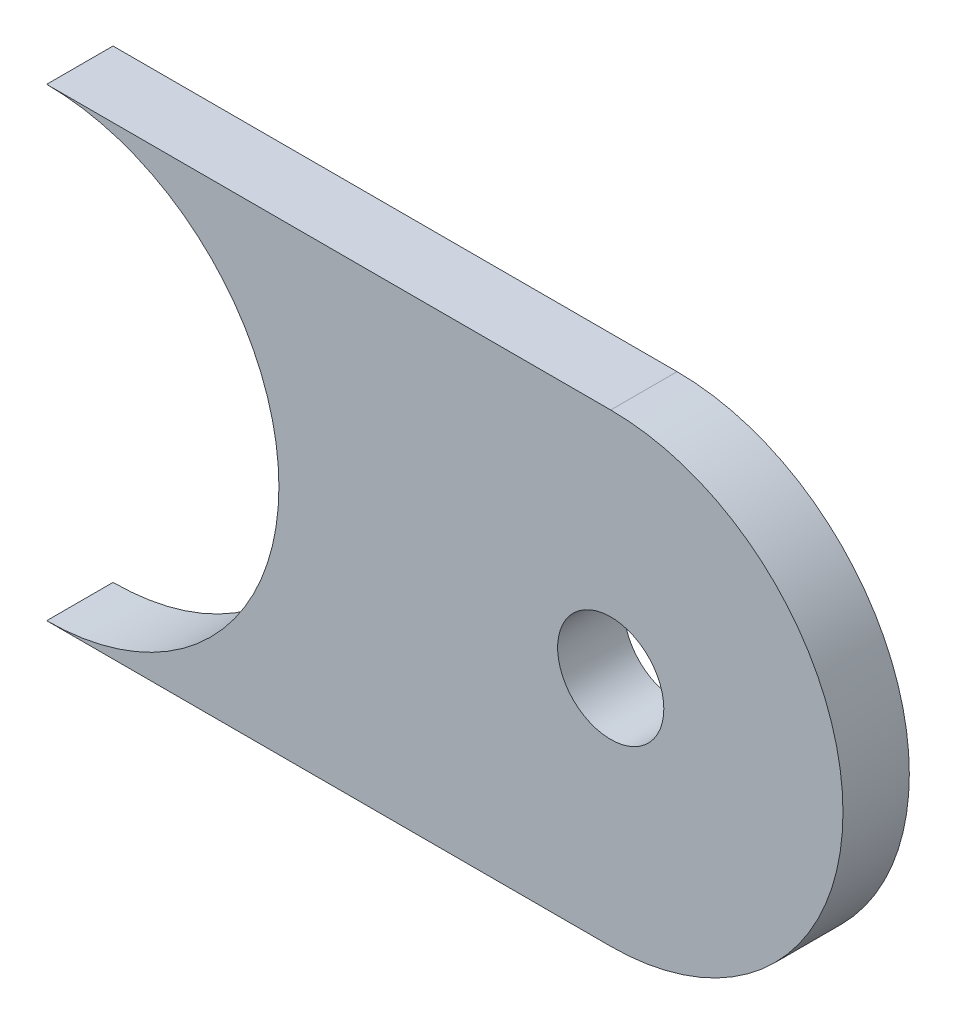
ISO-10303-21;
HEADER;
FILE_DESCRIPTION(('STEP AP214'),'2;1');
FILE_NAME('part.step','',(''),(''),'','','');
FILE_SCHEMA(('AUTOMOTIVE_DESIGN { 1 0 10303 214 1 1 1 1 }'));
ENDSEC;
DATA;
#1=APPLICATION_CONTEXT('core data for automotive mechanical design processes');
#2=APPLICATION_PROTOCOL_DEFINITION('international standard','automotive_design',2000,#1);
#3=PRODUCT_CONTEXT('',#1,'mechanical');
#4=PRODUCT('Part','Part','',(#3));
#5=PRODUCT_RELATED_PRODUCT_CATEGORY('part','',(#4));
#6=PRODUCT_DEFINITION_FORMATION('','',#4);
#7=PRODUCT_DEFINITION_CONTEXT('part definition',#1,'design');
#8=PRODUCT_DEFINITION('design','',#6,#7);
#9=PRODUCT_DEFINITION_SHAPE('','',#8);
#10=(LENGTH_UNIT() NAMED_UNIT(*) SI_UNIT(.MILLI.,.METRE.));
#11=(NAMED_UNIT(*) PLANE_ANGLE_UNIT() SI_UNIT($,.RADIAN.));
#12=(NAMED_UNIT(*) SI_UNIT($,.STERADIAN.) SOLID_ANGLE_UNIT());
#13=UNCERTAINTY_MEASURE_WITH_UNIT(LENGTH_MEASURE(1.E-05),#10,'distance_accuracy_value','');
#14=(GEOMETRIC_REPRESENTATION_CONTEXT(3) GLOBAL_UNCERTAINTY_ASSIGNED_CONTEXT((#13)) GLOBAL_UNIT_ASSIGNED_CONTEXT((#10,
#11,#12)) REPRESENTATION_CONTEXT('',''));
#15=CARTESIAN_POINT('',(0.,0.,0.));
#16=DIRECTION('',(0.,0.,1.));
#17=DIRECTION('',(1.,0.,0.));
#18=AXIS2_PLACEMENT_3D('',#15,#16,#17);
#19=CARTESIAN_POINT('',(-39.8681076232034,7.53253382096489,5.));
#20=DIRECTION('',(0.,0.,-1.));
#21=DIRECTION('',(-1.,0.,0.));
#22=AXIS2_PLACEMENT_3D('',#19,#20,#21);
#23=PLANE('',#22);
#24=CARTESIAN_POINT('',(-39.8681076232034,7.53253382096489,5.));
#25=DIRECTION('',(0.,0.,-1.));
#26=DIRECTION('',(-1.,0.,0.));
#27=AXIS2_PLACEMENT_3D('',#24,#25,#26);
#28=CIRCLE('',#27,17.5);
#29=CARTESIAN_POINT('',(-39.8681076232034,25.0325338209649,5.));
#30=VERTEX_POINT('',#29);
#31=CARTESIAN_POINT('',(-39.8681076232034,-9.96746617903511,5.));
#32=VERTEX_POINT('',#31);
#33=EDGE_CURVE('E86',#30,#32,#28,.T.);
#34=ORIENTED_EDGE('',*,*,#33,.T.);
#35=DIRECTION('',(1.,0.,0.));
#36=VECTOR('',#35,1.);
#37=CARTESIAN_POINT('',(-39.8681076232034,-9.96746617903511,5.));
#38=LINE('',#37,#36);
#39=CARTESIAN_POINT('',(2.63189237679662,-9.96746617903511,5.));
#40=VERTEX_POINT('',#39);
#41=EDGE_CURVE('E81',#32,#40,#38,.T.);
#42=ORIENTED_EDGE('',*,*,#41,.T.);
#43=CARTESIAN_POINT('',(2.63189237679663,7.53253382096489,5.));
#44=DIRECTION('',(0.,0.,1.));
#45=DIRECTION('',(1.,0.,0.));
#46=AXIS2_PLACEMENT_3D('',#43,#44,#45);
#47=CIRCLE('',#46,17.5);
#48=CARTESIAN_POINT('',(2.63189237679663,25.0325338209649,5.));
#49=VERTEX_POINT('',#48);
#50=EDGE_CURVE('E84',#40,#49,#47,.T.);
#51=ORIENTED_EDGE('',*,*,#50,.T.);
#52=DIRECTION('',(-1.,0.,0.));
#53=VECTOR('',#52,1.);
#54=CARTESIAN_POINT('',(-39.8681076232034,25.0325338209649,5.));
#55=LINE('',#54,#53);
#56=EDGE_CURVE('E51',#49,#30,#55,.T.);
#57=ORIENTED_EDGE('',*,*,#56,.T.);
#58=EDGE_LOOP('',(#34,#42,#51,#57));
#59=FACE_BOUND('',#58,.T.);
#60=CARTESIAN_POINT('',(2.63189237679663,7.53253382096489,5.));
#61=DIRECTION('',(0.,0.,1.));
#62=DIRECTION('',(1.,0.,0.));
#63=AXIS2_PLACEMENT_3D('',#60,#61,#62);
#64=CIRCLE('',#63,4.);
#65=CARTESIAN_POINT('',(6.63189237679663,7.53253382096489,5.));
#66=VERTEX_POINT('',#65);
#67=EDGE_CURVE('E101',#66,#66,#64,.T.);
#68=ORIENTED_EDGE('',*,*,#67,.F.);
#69=EDGE_LOOP('',(#68));
#70=FACE_BOUND('',#69,.T.);
#71=ADVANCED_FACE('F34',(#59,#70),#23,.F.);
#72=CARTESIAN_POINT('',(-39.8681076232034,7.53253382096489,0.));
#73=DIRECTION('',(0.,0.,-1.));
#74=DIRECTION('',(-1.,0.,0.));
#75=AXIS2_PLACEMENT_3D('',#72,#73,#74);
#76=PLANE('',#75);
#77=CARTESIAN_POINT('',(-39.8681076232034,7.53253382096489,0.));
#78=DIRECTION('',(0.,0.,-1.));
#79=DIRECTION('',(-1.,0.,0.));
#80=AXIS2_PLACEMENT_3D('',#77,#78,#79);
#81=CIRCLE('',#80,17.5);
#82=CARTESIAN_POINT('',(-39.8681076232034,25.0325338209649,0.));
#83=VERTEX_POINT('',#82);
#84=CARTESIAN_POINT('',(-39.8681076232034,-9.96746617903511,0.));
#85=VERTEX_POINT('',#84);
#86=EDGE_CURVE('E98',#83,#85,#81,.T.);
#87=ORIENTED_EDGE('',*,*,#86,.F.);
#88=DIRECTION('',(-1.,0.,0.));
#89=VECTOR('',#88,1.);
#90=CARTESIAN_POINT('',(-39.8681076232034,25.0325338209649,0.));
#91=LINE('',#90,#89);
#92=CARTESIAN_POINT('',(2.63189237679663,25.0325338209649,0.));
#93=VERTEX_POINT('',#92);
#94=EDGE_CURVE('E74',#93,#83,#91,.T.);
#95=ORIENTED_EDGE('',*,*,#94,.F.);
#96=CARTESIAN_POINT('',(2.63189237679663,7.53253382096489,0.));
#97=DIRECTION('',(0.,0.,1.));
#98=DIRECTION('',(1.,0.,0.));
#99=AXIS2_PLACEMENT_3D('',#96,#97,#98);
#100=CIRCLE('',#99,17.5);
#101=CARTESIAN_POINT('',(2.63189237679662,-9.96746617903511,0.));
#102=VERTEX_POINT('',#101);
#103=EDGE_CURVE('E68',#102,#93,#100,.T.);
#104=ORIENTED_EDGE('',*,*,#103,.F.);
#105=DIRECTION('',(1.,0.,0.));
#106=VECTOR('',#105,1.);
#107=CARTESIAN_POINT('',(-39.8681076232034,-9.96746617903511,0.));
#108=LINE('',#107,#106);
#109=EDGE_CURVE('E90',#85,#102,#108,.T.);
#110=ORIENTED_EDGE('',*,*,#109,.F.);
#111=EDGE_LOOP('',(#87,#95,#104,#110));
#112=FACE_BOUND('',#111,.T.);
#113=CARTESIAN_POINT('',(2.63189237679663,7.53253382096489,0.));
#114=DIRECTION('',(0.,0.,1.));
#115=DIRECTION('',(1.,0.,0.));
#116=AXIS2_PLACEMENT_3D('',#113,#114,#115);
#117=CIRCLE('',#116,4.);
#118=CARTESIAN_POINT('',(6.63189237679663,7.53253382096489,0.));
#119=VERTEX_POINT('',#118);
#120=EDGE_CURVE('E113',#119,#119,#117,.T.);
#121=ORIENTED_EDGE('',*,*,#120,.T.);
#122=EDGE_LOOP('',(#121));
#123=FACE_BOUND('',#122,.T.);
#124=ADVANCED_FACE('F109',(#112,#123),#76,.T.);
#125=CARTESIAN_POINT('',(-39.8681076232034,7.53253382096489,5.));
#126=DIRECTION('',(0.,0.,-1.));
#127=DIRECTION('',(-1.,0.,0.));
#128=AXIS2_PLACEMENT_3D('',#125,#126,#127);
#129=CYLINDRICAL_SURFACE('',#128,17.5);
#130=ORIENTED_EDGE('',*,*,#86,.T.);
#131=DIRECTION('',(0.,0.,-1.));
#132=VECTOR('',#131,1.);
#133=CARTESIAN_POINT('',(-39.8681076232034,-9.96746617903511,5.));
#134=LINE('',#133,#132);
#135=EDGE_CURVE('E11',#32,#85,#134,.T.);
#136=ORIENTED_EDGE('',*,*,#135,.F.);
#137=ORIENTED_EDGE('',*,*,#33,.F.);
#138=DIRECTION('',(0.,0.,-1.));
#139=VECTOR('',#138,1.);
#140=CARTESIAN_POINT('',(-39.8681076232034,25.0325338209649,5.));
#141=LINE('',#140,#139);
#142=EDGE_CURVE('E94',#30,#83,#141,.T.);
#143=ORIENTED_EDGE('',*,*,#142,.T.);
#144=EDGE_LOOP('',(#130,#136,#137,#143));
#145=FACE_BOUND('',#144,.T.);
#146=ADVANCED_FACE('F36',(#145),#129,.F.);
#147=CARTESIAN_POINT('',(-39.8681076232034,-9.96746617903511,5.));
#148=DIRECTION('',(0.,1.,0.));
#149=DIRECTION('',(0.,0.,1.));
#150=AXIS2_PLACEMENT_3D('',#147,#148,#149);
#151=PLANE('',#150);
#152=ORIENTED_EDGE('',*,*,#109,.T.);
#153=DIRECTION('',(0.,0.,-1.));
#154=VECTOR('',#153,1.);
#155=CARTESIAN_POINT('',(2.63189237679662,-9.96746617903511,5.));
#156=LINE('',#155,#154);
#157=EDGE_CURVE('E43',#40,#102,#156,.T.);
#158=ORIENTED_EDGE('',*,*,#157,.F.);
#159=ORIENTED_EDGE('',*,*,#41,.F.);
#160=ORIENTED_EDGE('',*,*,#135,.T.);
#161=EDGE_LOOP('',(#152,#158,#159,#160));
#162=FACE_BOUND('',#161,.T.);
#163=ADVANCED_FACE('F89',(#162),#151,.F.);
#164=CARTESIAN_POINT('',(2.63189237679663,7.53253382096489,5.));
#165=DIRECTION('',(0.,0.,-1.));
#166=DIRECTION('',(-1.,0.,0.));
#167=AXIS2_PLACEMENT_3D('',#164,#165,#166);
#168=CYLINDRICAL_SURFACE('',#167,17.5);
#169=ORIENTED_EDGE('',*,*,#103,.T.);
#170=DIRECTION('',(0.,0.,-1.));
#171=VECTOR('',#170,1.);
#172=CARTESIAN_POINT('',(2.63189237679663,25.0325338209649,5.));
#173=LINE('',#172,#171);
#174=EDGE_CURVE('E91',#49,#93,#173,.T.);
#175=ORIENTED_EDGE('',*,*,#174,.F.);
#176=ORIENTED_EDGE('',*,*,#50,.F.);
#177=ORIENTED_EDGE('',*,*,#157,.T.);
#178=EDGE_LOOP('',(#169,#175,#176,#177));
#179=FACE_BOUND('',#178,.T.);
#180=ADVANCED_FACE('F92',(#179),#168,.T.);
#181=CARTESIAN_POINT('',(-39.8681076232034,25.0325338209649,5.));
#182=DIRECTION('',(0.,-1.,0.));
#183=DIRECTION('',(0.,0.,-1.));
#184=AXIS2_PLACEMENT_3D('',#181,#182,#183);
#185=PLANE('',#184);
#186=ORIENTED_EDGE('',*,*,#94,.T.);
#187=ORIENTED_EDGE('',*,*,#142,.F.);
#188=ORIENTED_EDGE('',*,*,#56,.F.);
#189=ORIENTED_EDGE('',*,*,#174,.T.);
#190=EDGE_LOOP('',(#186,#187,#188,#189));
#191=FACE_BOUND('',#190,.T.);
#192=ADVANCED_FACE('F106',(#191),#185,.F.);
#193=CARTESIAN_POINT('',(2.63189237679663,7.53253382096489,5.));
#194=DIRECTION('',(0.,0.,-1.));
#195=DIRECTION('',(-1.,0.,0.));
#196=AXIS2_PLACEMENT_3D('',#193,#194,#195);
#197=CYLINDRICAL_SURFACE('',#196,4.);
#198=ORIENTED_EDGE('',*,*,#67,.T.);
#199=EDGE_LOOP('',(#198));
#200=FACE_BOUND('',#199,.T.);
#201=ORIENTED_EDGE('',*,*,#120,.F.);
#202=EDGE_LOOP('',(#201));
#203=FACE_BOUND('',#202,.T.);
#204=ADVANCED_FACE('F119',(#200,#203),#197,.F.);
#205=CLOSED_SHELL('',(#71,#124,#146,#163,#180,#192,#204));
#206=MANIFOLD_SOLID_BREP('B2',#205);
#207=ADVANCED_BREP_SHAPE_REPRESENTATION('',(#18,#206),#14);
#208=SHAPE_DEFINITION_REPRESENTATION(#9,#207);
ENDSEC;
END-ISO-10303-21;
